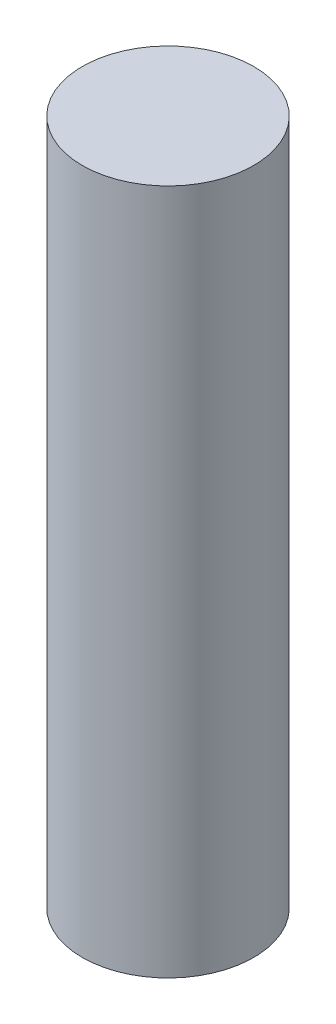
ISO-10303-21;
HEADER;
FILE_DESCRIPTION(('STEP AP214'),'2;1');
FILE_NAME('part.step','',(''),(''),'','','');
FILE_SCHEMA(('AUTOMOTIVE_DESIGN { 1 0 10303 214 1 1 1 1 }'));
ENDSEC;
DATA;
#1=APPLICATION_CONTEXT('core data for automotive mechanical design processes');
#2=APPLICATION_PROTOCOL_DEFINITION('international standard','automotive_design',2000,#1);
#3=PRODUCT_CONTEXT('',#1,'mechanical');
#4=PRODUCT('Part','Part','',(#3));
#5=PRODUCT_RELATED_PRODUCT_CATEGORY('part','',(#4));
#6=PRODUCT_DEFINITION_FORMATION('','',#4);
#7=PRODUCT_DEFINITION_CONTEXT('part definition',#1,'design');
#8=PRODUCT_DEFINITION('design','',#6,#7);
#9=PRODUCT_DEFINITION_SHAPE('','',#8);
#10=(LENGTH_UNIT() NAMED_UNIT(*) SI_UNIT(.MILLI.,.METRE.));
#11=(NAMED_UNIT(*) PLANE_ANGLE_UNIT() SI_UNIT($,.RADIAN.));
#12=(NAMED_UNIT(*) SI_UNIT($,.STERADIAN.) SOLID_ANGLE_UNIT());
#13=UNCERTAINTY_MEASURE_WITH_UNIT(LENGTH_MEASURE(1.E-05),#10,'distance_accuracy_value','');
#14=(GEOMETRIC_REPRESENTATION_CONTEXT(3) GLOBAL_UNCERTAINTY_ASSIGNED_CONTEXT((#13)) GLOBAL_UNIT_ASSIGNED_CONTEXT((#10,
#11,#12)) REPRESENTATION_CONTEXT('',''));
#15=CARTESIAN_POINT('',(0.,0.,0.));
#16=DIRECTION('',(0.,0.,1.));
#17=DIRECTION('',(1.,0.,0.));
#18=AXIS2_PLACEMENT_3D('',#15,#16,#17);
#19=CARTESIAN_POINT('',(0.,80.,0.));
#20=DIRECTION('',(0.,-1.,0.));
#21=DIRECTION('',(0.,0.,-1.));
#22=AXIS2_PLACEMENT_3D('',#19,#20,#21);
#23=CYLINDRICAL_SURFACE('',#22,7.5);
#24=CARTESIAN_POINT('',(0.,0.,0.));
#25=DIRECTION('',(0.,1.,0.));
#26=DIRECTION('',(0.,0.,1.));
#27=AXIS2_PLACEMENT_3D('',#24,#25,#26);
#28=CIRCLE('',#27,7.5);
#29=CARTESIAN_POINT('',(0.,0.,7.5));
#30=VERTEX_POINT('',#29);
#31=EDGE_CURVE('E47',#30,#30,#28,.T.);
#32=ORIENTED_EDGE('',*,*,#31,.F.);
#33=EDGE_LOOP('',(#32));
#34=FACE_BOUND('',#33,.T.);
#35=CARTESIAN_POINT('',(0.,75.,0.));
#36=DIRECTION('',(0.,1.,0.));
#37=DIRECTION('',(0.,0.,1.));
#38=AXIS2_PLACEMENT_3D('',#35,#36,#37);
#39=CIRCLE('',#38,7.5);
#40=CARTESIAN_POINT('',(0.,75.,7.5));
#41=VERTEX_POINT('',#40);
#42=EDGE_CURVE('E51',#41,#41,#39,.T.);
#43=ORIENTED_EDGE('',*,*,#42,.T.);
#44=EDGE_LOOP('',(#43));
#45=FACE_BOUND('',#44,.T.);
#46=ADVANCED_FACE('F36',(#34,#45),#23,.F.);
#47=CARTESIAN_POINT('',(0.,80.,0.));
#48=DIRECTION('',(0.,1.,0.));
#49=DIRECTION('',(0.,0.,1.));
#50=AXIS2_PLACEMENT_3D('',#47,#48,#49);
#51=PLANE('',#50);
#52=CARTESIAN_POINT('',(0.,80.,0.));
#53=DIRECTION('',(0.,1.,0.));
#54=DIRECTION('',(0.,0.,1.));
#55=AXIS2_PLACEMENT_3D('',#52,#53,#54);
#56=CIRCLE('',#55,10.);
#57=CARTESIAN_POINT('',(0.,80.,10.));
#58=VERTEX_POINT('',#57);
#59=EDGE_CURVE('E10',#58,#58,#56,.T.);
#60=ORIENTED_EDGE('',*,*,#59,.T.);
#61=EDGE_LOOP('',(#60));
#62=FACE_BOUND('',#61,.T.);
#63=ADVANCED_FACE('F66',(#62),#51,.T.);
#64=CARTESIAN_POINT('',(0.,0.,0.));
#65=DIRECTION('',(0.,1.,0.));
#66=DIRECTION('',(0.,0.,1.));
#67=AXIS2_PLACEMENT_3D('',#64,#65,#66);
#68=PLANE('',#67);
#69=CARTESIAN_POINT('',(0.,0.,0.));
#70=DIRECTION('',(0.,1.,0.));
#71=DIRECTION('',(0.,0.,1.));
#72=AXIS2_PLACEMENT_3D('',#69,#70,#71);
#73=CIRCLE('',#72,10.);
#74=CARTESIAN_POINT('',(0.,0.,10.));
#75=VERTEX_POINT('',#74);
#76=EDGE_CURVE('E40',#75,#75,#73,.T.);
#77=ORIENTED_EDGE('',*,*,#76,.F.);
#78=EDGE_LOOP('',(#77));
#79=FACE_BOUND('',#78,.T.);
#80=ORIENTED_EDGE('',*,*,#31,.T.);
#81=EDGE_LOOP('',(#80));
#82=FACE_BOUND('',#81,.T.);
#83=ADVANCED_FACE('F62',(#79,#82),#68,.F.);
#84=CARTESIAN_POINT('',(0.,80.,0.));
#85=DIRECTION('',(0.,-1.,0.));
#86=DIRECTION('',(0.,0.,-1.));
#87=AXIS2_PLACEMENT_3D('',#84,#85,#86);
#88=CYLINDRICAL_SURFACE('',#87,10.);
#89=ORIENTED_EDGE('',*,*,#59,.F.);
#90=EDGE_LOOP('',(#89));
#91=FACE_BOUND('',#90,.T.);
#92=ORIENTED_EDGE('',*,*,#76,.T.);
#93=EDGE_LOOP('',(#92));
#94=FACE_BOUND('',#93,.T.);
#95=ADVANCED_FACE('F38',(#91,#94),#88,.T.);
#96=CARTESIAN_POINT('',(0.,75.,0.));
#97=DIRECTION('',(0.,1.,0.));
#98=DIRECTION('',(0.,0.,1.));
#99=AXIS2_PLACEMENT_3D('',#96,#97,#98);
#100=PLANE('',#99);
#101=ORIENTED_EDGE('',*,*,#42,.F.);
#102=EDGE_LOOP('',(#101));
#103=FACE_BOUND('',#102,.T.);
#104=ADVANCED_FACE('F56',(#103),#100,.F.);
#105=CLOSED_SHELL('',(#46,#63,#83,#95,#104));
#106=MANIFOLD_SOLID_BREP('B2',#105);
#107=ADVANCED_BREP_SHAPE_REPRESENTATION('',(#18,#106),#14);
#108=SHAPE_DEFINITION_REPRESENTATION(#9,#107);
ENDSEC;
END-ISO-10303-21;
